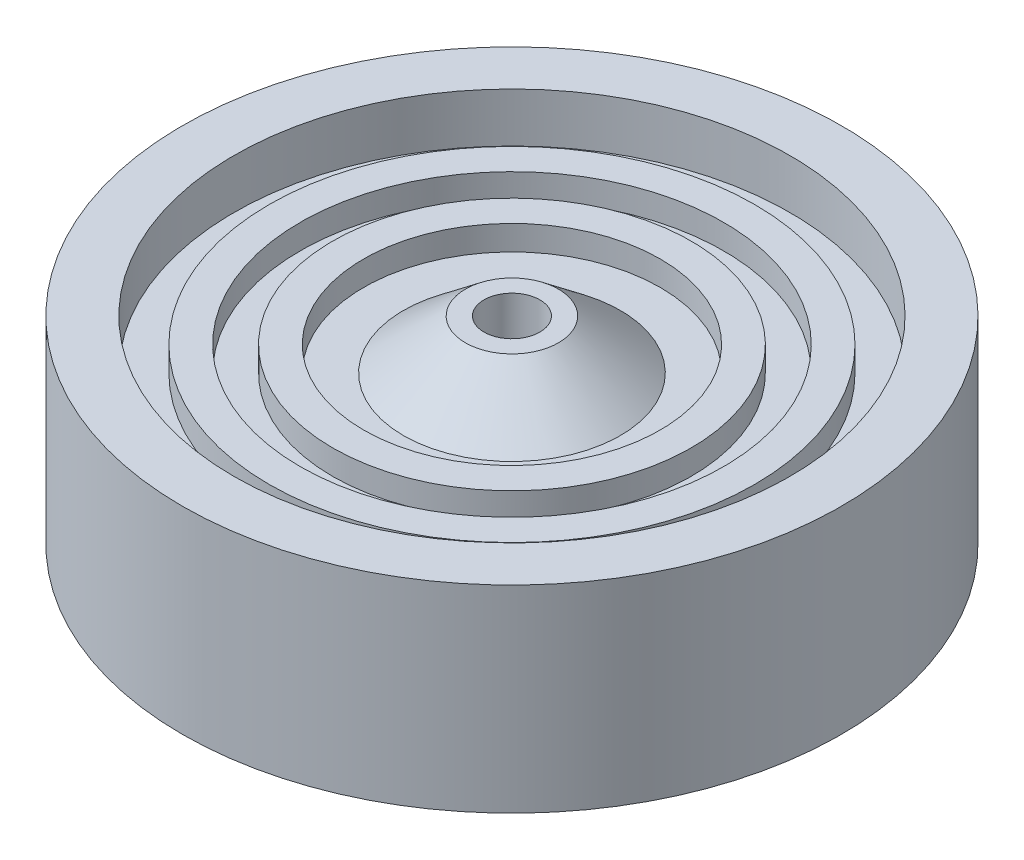
ISO-10303-21;
HEADER;
FILE_DESCRIPTION(('STEP AP214'),'2;1');
FILE_NAME('part.step','',(''),(''),'','','');
FILE_SCHEMA(('AUTOMOTIVE_DESIGN { 1 0 10303 214 1 1 1 1 }'));
ENDSEC;
DATA;
#1=APPLICATION_CONTEXT('core data for automotive mechanical design processes');
#2=APPLICATION_PROTOCOL_DEFINITION('international standard','automotive_design',2000,#1);
#3=PRODUCT_CONTEXT('',#1,'mechanical');
#4=PRODUCT('Part','Part','',(#3));
#5=PRODUCT_RELATED_PRODUCT_CATEGORY('part','',(#4));
#6=PRODUCT_DEFINITION_FORMATION('','',#4);
#7=PRODUCT_DEFINITION_CONTEXT('part definition',#1,'design');
#8=PRODUCT_DEFINITION('design','',#6,#7);
#9=PRODUCT_DEFINITION_SHAPE('','',#8);
#10=(LENGTH_UNIT() NAMED_UNIT(*) SI_UNIT(.MILLI.,.METRE.));
#11=(NAMED_UNIT(*) PLANE_ANGLE_UNIT() SI_UNIT($,.RADIAN.));
#12=(NAMED_UNIT(*) SI_UNIT($,.STERADIAN.) SOLID_ANGLE_UNIT());
#13=UNCERTAINTY_MEASURE_WITH_UNIT(LENGTH_MEASURE(1.E-05),#10,'distance_accuracy_value','');
#14=(GEOMETRIC_REPRESENTATION_CONTEXT(3) GLOBAL_UNCERTAINTY_ASSIGNED_CONTEXT((#13)) GLOBAL_UNIT_ASSIGNED_CONTEXT((#10,
#11,#12)) REPRESENTATION_CONTEXT('',''));
#15=CARTESIAN_POINT('',(0.,0.,0.));
#16=DIRECTION('',(0.,0.,1.));
#17=DIRECTION('',(1.,0.,0.));
#18=AXIS2_PLACEMENT_3D('',#15,#16,#17);
#19=CARTESIAN_POINT('',(-62.2703870083176,102.893499589616,0.));
#20=DIRECTION('',(0.,1.,0.));
#21=DIRECTION('',(0.,0.,1.));
#22=AXIS2_PLACEMENT_3D('',#19,#20,#21);
#23=PLANE('',#22);
#24=CARTESIAN_POINT('',(-50.811787608486,102.893499589616,0.));
#25=DIRECTION('',(0.,1.,0.));
#26=DIRECTION('',(0.,0.,1.));
#27=AXIS2_PLACEMENT_3D('',#24,#25,#26);
#28=CIRCLE('',#27,11.4585993998316);
#29=CARTESIAN_POINT('',(-50.811787608486,102.893499589616,11.4585993998316));
#30=VERTEX_POINT('',#29);
#31=EDGE_CURVE('E152',#30,#30,#28,.T.);
#32=ORIENTED_EDGE('',*,*,#31,.T.);
#33=EDGE_LOOP('',(#32));
#34=FACE_BOUND('',#33,.T.);
#35=CARTESIAN_POINT('',(-50.811787608486,102.893499589616,0.));
#36=DIRECTION('',(0.,1.,0.));
#37=DIRECTION('',(0.,0.,1.));
#38=AXIS2_PLACEMENT_3D('',#35,#36,#37);
#39=CIRCLE('',#38,6.8841638736265);
#40=CARTESIAN_POINT('',(-50.811787608486,102.893499589616,6.8841638736265));
#41=VERTEX_POINT('',#40);
#42=EDGE_CURVE('E10',#41,#41,#39,.T.);
#43=ORIENTED_EDGE('',*,*,#42,.F.);
#44=EDGE_LOOP('',(#43));
#45=FACE_BOUND('',#44,.T.);
#46=ADVANCED_FACE('F37',(#34,#45),#23,.T.);
#47=CARTESIAN_POINT('',(-50.811787608486,150.598792189007,0.));
#48=DIRECTION('',(0.,1.,0.));
#49=DIRECTION('',(0.,0.,1.));
#50=AXIS2_PLACEMENT_3D('',#47,#48,#49);
#51=CYLINDRICAL_SURFACE('',#50,6.8841638736265);
#52=ORIENTED_EDGE('',*,*,#42,.T.);
#53=EDGE_LOOP('',(#52));
#54=FACE_BOUND('',#53,.T.);
#55=CARTESIAN_POINT('',(-50.811787608486,54.2353215289949,0.));
#56=DIRECTION('',(0.,1.,0.));
#57=DIRECTION('',(0.,0.,1.));
#58=AXIS2_PLACEMENT_3D('',#55,#56,#57);
#59=CIRCLE('',#58,6.8841638736265);
#60=CARTESIAN_POINT('',(-50.811787608486,54.2353215289949,6.8841638736265));
#61=VERTEX_POINT('',#60);
#62=EDGE_CURVE('E44',#61,#61,#59,.T.);
#63=ORIENTED_EDGE('',*,*,#62,.F.);
#64=EDGE_LOOP('',(#63));
#65=FACE_BOUND('',#64,.T.);
#66=ADVANCED_FACE('F171',(#54,#65),#51,.F.);
#67=CARTESIAN_POINT('',(-57.6959514821125,54.2353215289949,0.));
#68=DIRECTION('',(0.,-1.,0.));
#69=DIRECTION('',(0.,0.,-1.));
#70=AXIS2_PLACEMENT_3D('',#67,#68,#69);
#71=PLANE('',#70);
#72=ORIENTED_EDGE('',*,*,#62,.T.);
#73=EDGE_LOOP('',(#72));
#74=FACE_BOUND('',#73,.T.);
#75=CARTESIAN_POINT('',(-50.811787608486,54.2353215289949,0.));
#76=DIRECTION('',(0.,1.,0.));
#77=DIRECTION('',(0.,0.,1.));
#78=AXIS2_PLACEMENT_3D('',#75,#76,#77);
#79=CIRCLE('',#78,11.4585993998316);
#80=CARTESIAN_POINT('',(-50.811787608486,54.2353215289949,11.4585993998316));
#81=VERTEX_POINT('',#80);
#82=EDGE_CURVE('E49',#81,#81,#79,.T.);
#83=ORIENTED_EDGE('',*,*,#82,.F.);
#84=EDGE_LOOP('',(#83));
#85=FACE_BOUND('',#84,.T.);
#86=ADVANCED_FACE('F175',(#74,#85),#71,.T.);
#87=CARTESIAN_POINT('',(-50.811787608486,66.3998660441503,0.));
#88=DIRECTION('',(0.,1.,0.));
#89=DIRECTION('',(0.,0.,1.));
#90=AXIS2_PLACEMENT_3D('',#87,#88,#89);
#91=CONICAL_SURFACE('',#90,26.7096701352503,0.897508871919878);
#92=ORIENTED_EDGE('',*,*,#82,.T.);
#93=EDGE_LOOP('',(#92));
#94=FACE_BOUND('',#93,.T.);
#95=CARTESIAN_POINT('',(-50.811787608486,66.3998660441503,0.));
#96=DIRECTION('',(0.,1.,0.));
#97=DIRECTION('',(0.,0.,1.));
#98=AXIS2_PLACEMENT_3D('',#95,#96,#97);
#99=CIRCLE('',#98,26.7096701352503);
#100=CARTESIAN_POINT('',(-50.811787608486,66.3998660441503,26.7096701352503));
#101=VERTEX_POINT('',#100);
#102=EDGE_CURVE('E54',#101,#101,#99,.T.);
#103=ORIENTED_EDGE('',*,*,#102,.F.);
#104=EDGE_LOOP('',(#103));
#105=FACE_BOUND('',#104,.T.);
#106=ADVANCED_FACE('F179',(#94,#105),#91,.T.);
#107=CARTESIAN_POINT('',(-77.5214577437363,66.3998660441503,0.));
#108=DIRECTION('',(0.,-1.,0.));
#109=DIRECTION('',(0.,0.,-1.));
#110=AXIS2_PLACEMENT_3D('',#107,#108,#109);
#111=PLANE('',#110);
#112=ORIENTED_EDGE('',*,*,#102,.T.);
#113=EDGE_LOOP('',(#112));
#114=FACE_BOUND('',#113,.T.);
#115=CARTESIAN_POINT('',(-50.811787608486,66.3998660441503,0.));
#116=DIRECTION('',(0.,1.,0.));
#117=DIRECTION('',(0.,0.,1.));
#118=AXIS2_PLACEMENT_3D('',#115,#116,#117);
#119=CIRCLE('',#118,36.5139298937337);
#120=CARTESIAN_POINT('',(-50.811787608486,66.3998660441503,36.5139298937337));
#121=VERTEX_POINT('',#120);
#122=EDGE_CURVE('E60',#121,#121,#119,.T.);
#123=ORIENTED_EDGE('',*,*,#122,.F.);
#124=EDGE_LOOP('',(#123));
#125=FACE_BOUND('',#124,.T.);
#126=ADVANCED_FACE('F185',(#114,#125),#111,.T.);
#127=CARTESIAN_POINT('',(-50.811787608486,150.598792189007,0.));
#128=DIRECTION('',(0.,1.,0.));
#129=DIRECTION('',(0.,0.,1.));
#130=AXIS2_PLACEMENT_3D('',#127,#128,#129);
#131=CYLINDRICAL_SURFACE('',#130,36.5139298937337);
#132=ORIENTED_EDGE('',*,*,#122,.T.);
#133=EDGE_LOOP('',(#132));
#134=FACE_BOUND('',#133,.T.);
#135=CARTESIAN_POINT('',(-50.811787608486,60.3175937865726,0.));
#136=DIRECTION('',(0.,1.,0.));
#137=DIRECTION('',(0.,0.,1.));
#138=AXIS2_PLACEMENT_3D('',#135,#136,#137);
#139=CIRCLE('',#138,36.5139298937337);
#140=CARTESIAN_POINT('',(-50.811787608486,60.3175937865726,36.5139298937337));
#141=VERTEX_POINT('',#140);
#142=EDGE_CURVE('E64',#141,#141,#139,.T.);
#143=ORIENTED_EDGE('',*,*,#142,.F.);
#144=EDGE_LOOP('',(#143));
#145=FACE_BOUND('',#144,.T.);
#146=ADVANCED_FACE('F189',(#134,#145),#131,.F.);
#147=CARTESIAN_POINT('',(-87.3257175022198,60.3175937865726,0.));
#148=DIRECTION('',(0.,-1.,0.));
#149=DIRECTION('',(0.,0.,-1.));
#150=AXIS2_PLACEMENT_3D('',#147,#148,#149);
#151=PLANE('',#150);
#152=ORIENTED_EDGE('',*,*,#142,.T.);
#153=EDGE_LOOP('',(#152));
#154=FACE_BOUND('',#153,.T.);
#155=CARTESIAN_POINT('',(-50.811787608486,60.3175937865726,0.));
#156=DIRECTION('',(0.,1.,0.));
#157=DIRECTION('',(0.,0.,1.));
#158=AXIS2_PLACEMENT_3D('',#155,#156,#157);
#159=CIRCLE('',#158,44.1339298937337);
#160=CARTESIAN_POINT('',(-50.811787608486,60.3175937865726,44.1339298937337));
#161=VERTEX_POINT('',#160);
#162=EDGE_CURVE('E68',#161,#161,#159,.T.);
#163=ORIENTED_EDGE('',*,*,#162,.F.);
#164=EDGE_LOOP('',(#163));
#165=FACE_BOUND('',#164,.T.);
#166=ADVANCED_FACE('F193',(#154,#165),#151,.T.);
#167=CARTESIAN_POINT('',(-50.811787608486,150.598792189007,0.));
#168=DIRECTION('',(0.,1.,0.));
#169=DIRECTION('',(0.,0.,1.));
#170=AXIS2_PLACEMENT_3D('',#167,#168,#169);
#171=CYLINDRICAL_SURFACE('',#170,44.1339298937337);
#172=ORIENTED_EDGE('',*,*,#162,.T.);
#173=EDGE_LOOP('',(#172));
#174=FACE_BOUND('',#173,.T.);
#175=CARTESIAN_POINT('',(-50.811787608486,66.3998660441503,0.));
#176=DIRECTION('',(0.,1.,0.));
#177=DIRECTION('',(0.,0.,1.));
#178=AXIS2_PLACEMENT_3D('',#175,#176,#177);
#179=CIRCLE('',#178,44.1339298937337);
#180=CARTESIAN_POINT('',(-50.811787608486,66.3998660441503,44.1339298937337));
#181=VERTEX_POINT('',#180);
#182=EDGE_CURVE('E72',#181,#181,#179,.T.);
#183=ORIENTED_EDGE('',*,*,#182,.F.);
#184=EDGE_LOOP('',(#183));
#185=FACE_BOUND('',#184,.T.);
#186=ADVANCED_FACE('F197',(#174,#185),#171,.T.);
#187=CARTESIAN_POINT('',(-94.9457175022198,66.3998660441503,0.));
#188=DIRECTION('',(0.,-1.,0.));
#189=DIRECTION('',(0.,0.,-1.));
#190=AXIS2_PLACEMENT_3D('',#187,#188,#189);
#191=PLANE('',#190);
#192=ORIENTED_EDGE('',*,*,#182,.T.);
#193=EDGE_LOOP('',(#192));
#194=FACE_BOUND('',#193,.T.);
#195=CARTESIAN_POINT('',(-50.811787608486,66.3998660441503,0.));
#196=DIRECTION('',(0.,1.,0.));
#197=DIRECTION('',(0.,0.,1.));
#198=AXIS2_PLACEMENT_3D('',#195,#196,#197);
#199=CIRCLE('',#198,52.1225859932388);
#200=CARTESIAN_POINT('',(-50.811787608486,66.3998660441503,52.1225859932388));
#201=VERTEX_POINT('',#200);
#202=EDGE_CURVE('E76',#201,#201,#199,.T.);
#203=ORIENTED_EDGE('',*,*,#202,.F.);
#204=EDGE_LOOP('',(#203));
#205=FACE_BOUND('',#204,.T.);
#206=ADVANCED_FACE('F201',(#194,#205),#191,.T.);
#207=CARTESIAN_POINT('',(-50.811787608486,150.598792189007,0.));
#208=DIRECTION('',(0.,1.,0.));
#209=DIRECTION('',(0.,0.,1.));
#210=AXIS2_PLACEMENT_3D('',#207,#208,#209);
#211=CYLINDRICAL_SURFACE('',#210,52.1225859932388);
#212=ORIENTED_EDGE('',*,*,#202,.T.);
#213=EDGE_LOOP('',(#212));
#214=FACE_BOUND('',#213,.T.);
#215=CARTESIAN_POINT('',(-50.811787608486,60.3175937865726,0.));
#216=DIRECTION('',(0.,1.,0.));
#217=DIRECTION('',(0.,0.,1.));
#218=AXIS2_PLACEMENT_3D('',#215,#216,#217);
#219=CIRCLE('',#218,52.1225859932388);
#220=CARTESIAN_POINT('',(-50.811787608486,60.3175937865726,52.1225859932388));
#221=VERTEX_POINT('',#220);
#222=EDGE_CURVE('E80',#221,#221,#219,.T.);
#223=ORIENTED_EDGE('',*,*,#222,.F.);
#224=EDGE_LOOP('',(#223));
#225=FACE_BOUND('',#224,.T.);
#226=ADVANCED_FACE('F205',(#214,#225),#211,.F.);
#227=CARTESIAN_POINT('',(-102.934373601725,60.3175937865726,0.));
#228=DIRECTION('',(0.,-1.,0.));
#229=DIRECTION('',(0.,0.,-1.));
#230=AXIS2_PLACEMENT_3D('',#227,#228,#229);
#231=PLANE('',#230);
#232=ORIENTED_EDGE('',*,*,#222,.T.);
#233=EDGE_LOOP('',(#232));
#234=FACE_BOUND('',#233,.T.);
#235=CARTESIAN_POINT('',(-50.811787608486,60.3175937865726,0.));
#236=DIRECTION('',(0.,1.,0.));
#237=DIRECTION('',(0.,0.,1.));
#238=AXIS2_PLACEMENT_3D('',#235,#236,#237);
#239=CIRCLE('',#238,59.7425859932388);
#240=CARTESIAN_POINT('',(-50.811787608486,60.3175937865726,59.7425859932388));
#241=VERTEX_POINT('',#240);
#242=EDGE_CURVE('E84',#241,#241,#239,.T.);
#243=ORIENTED_EDGE('',*,*,#242,.F.);
#244=EDGE_LOOP('',(#243));
#245=FACE_BOUND('',#244,.T.);
#246=ADVANCED_FACE('F209',(#234,#245),#231,.T.);
#247=CARTESIAN_POINT('',(-50.811787608486,150.598792189007,0.));
#248=DIRECTION('',(0.,1.,0.));
#249=DIRECTION('',(0.,0.,1.));
#250=AXIS2_PLACEMENT_3D('',#247,#248,#249);
#251=CYLINDRICAL_SURFACE('',#250,59.7425859932388);
#252=ORIENTED_EDGE('',*,*,#242,.T.);
#253=EDGE_LOOP('',(#252));
#254=FACE_BOUND('',#253,.T.);
#255=CARTESIAN_POINT('',(-50.811787608486,66.3998660441503,0.));
#256=DIRECTION('',(0.,1.,0.));
#257=DIRECTION('',(0.,0.,1.));
#258=AXIS2_PLACEMENT_3D('',#255,#256,#257);
#259=CIRCLE('',#258,59.7425859932388);
#260=CARTESIAN_POINT('',(-50.811787608486,66.3998660441503,59.7425859932388));
#261=VERTEX_POINT('',#260);
#262=EDGE_CURVE('E88',#261,#261,#259,.T.);
#263=ORIENTED_EDGE('',*,*,#262,.F.);
#264=EDGE_LOOP('',(#263));
#265=FACE_BOUND('',#264,.T.);
#266=ADVANCED_FACE('F213',(#254,#265),#251,.T.);
#267=CARTESIAN_POINT('',(-110.554373601725,66.3998660441503,0.));
#268=DIRECTION('',(0.,-1.,0.));
#269=DIRECTION('',(0.,0.,-1.));
#270=AXIS2_PLACEMENT_3D('',#267,#268,#269);
#271=PLANE('',#270);
#272=ORIENTED_EDGE('',*,*,#262,.T.);
#273=EDGE_LOOP('',(#272));
#274=FACE_BOUND('',#273,.T.);
#275=CARTESIAN_POINT('',(-50.811787608486,66.3998660441503,0.));
#276=DIRECTION('',(0.,1.,0.));
#277=DIRECTION('',(0.,0.,1.));
#278=AXIS2_PLACEMENT_3D('',#275,#276,#277);
#279=CIRCLE('',#278,68.4574835563352);
#280=CARTESIAN_POINT('',(-50.811787608486,66.3998660441503,68.4574835563352));
#281=VERTEX_POINT('',#280);
#282=EDGE_CURVE('E92',#281,#281,#279,.T.);
#283=ORIENTED_EDGE('',*,*,#282,.F.);
#284=EDGE_LOOP('',(#283));
#285=FACE_BOUND('',#284,.T.);
#286=ADVANCED_FACE('F217',(#274,#285),#271,.T.);
#287=CARTESIAN_POINT('',(-50.811787608486,150.598792189007,0.));
#288=DIRECTION('',(0.,1.,0.));
#289=DIRECTION('',(0.,0.,1.));
#290=AXIS2_PLACEMENT_3D('',#287,#288,#289);
#291=CYLINDRICAL_SURFACE('',#290,68.4574835563352);
#292=ORIENTED_EDGE('',*,*,#282,.T.);
#293=EDGE_LOOP('',(#292));
#294=FACE_BOUND('',#293,.T.);
#295=CARTESIAN_POINT('',(-50.811787608486,54.2353215289949,0.));
#296=DIRECTION('',(0.,1.,0.));
#297=DIRECTION('',(0.,0.,1.));
#298=AXIS2_PLACEMENT_3D('',#295,#296,#297);
#299=CIRCLE('',#298,68.4574835563352);
#300=CARTESIAN_POINT('',(-50.811787608486,54.2353215289949,68.4574835563352));
#301=VERTEX_POINT('',#300);
#302=EDGE_CURVE('E96',#301,#301,#299,.T.);
#303=ORIENTED_EDGE('',*,*,#302,.F.);
#304=EDGE_LOOP('',(#303));
#305=FACE_BOUND('',#304,.T.);
#306=ADVANCED_FACE('F221',(#294,#305),#291,.F.);
#307=CARTESIAN_POINT('',(-119.269271164821,54.2353215289949,0.));
#308=DIRECTION('',(0.,-1.,0.));
#309=DIRECTION('',(0.,0.,-1.));
#310=AXIS2_PLACEMENT_3D('',#307,#308,#309);
#311=PLANE('',#310);
#312=ORIENTED_EDGE('',*,*,#302,.T.);
#313=EDGE_LOOP('',(#312));
#314=FACE_BOUND('',#313,.T.);
#315=CARTESIAN_POINT('',(-50.811787608486,54.2353215289949,0.));
#316=DIRECTION('',(0.,1.,0.));
#317=DIRECTION('',(0.,0.,1.));
#318=AXIS2_PLACEMENT_3D('',#315,#316,#317);
#319=CIRCLE('',#318,81.1574835563352);
#320=CARTESIAN_POINT('',(-50.811787608486,54.2353215289949,81.1574835563352));
#321=VERTEX_POINT('',#320);
#322=EDGE_CURVE('E100',#321,#321,#319,.T.);
#323=ORIENTED_EDGE('',*,*,#322,.F.);
#324=EDGE_LOOP('',(#323));
#325=FACE_BOUND('',#324,.T.);
#326=ADVANCED_FACE('F225',(#314,#325),#311,.T.);
#327=CARTESIAN_POINT('',(-50.811787608486,150.598792189007,0.));
#328=DIRECTION('',(0.,1.,0.));
#329=DIRECTION('',(0.,0.,1.));
#330=AXIS2_PLACEMENT_3D('',#327,#328,#329);
#331=CYLINDRICAL_SURFACE('',#330,81.1574835563352);
#332=ORIENTED_EDGE('',*,*,#322,.T.);
#333=EDGE_LOOP('',(#332));
#334=FACE_BOUND('',#333,.T.);
#335=CARTESIAN_POINT('',(-50.811787608486,102.893499589616,0.));
#336=DIRECTION('',(0.,1.,0.));
#337=DIRECTION('',(0.,0.,1.));
#338=AXIS2_PLACEMENT_3D('',#335,#336,#337);
#339=CIRCLE('',#338,81.1574835563352);
#340=CARTESIAN_POINT('',(-50.811787608486,102.893499589616,81.1574835563352));
#341=VERTEX_POINT('',#340);
#342=EDGE_CURVE('E104',#341,#341,#339,.T.);
#343=ORIENTED_EDGE('',*,*,#342,.F.);
#344=EDGE_LOOP('',(#343));
#345=FACE_BOUND('',#344,.T.);
#346=ADVANCED_FACE('F229',(#334,#345),#331,.T.);
#347=CARTESIAN_POINT('',(-119.269271164821,102.893499589616,0.));
#348=DIRECTION('',(0.,1.,0.));
#349=DIRECTION('',(0.,0.,1.));
#350=AXIS2_PLACEMENT_3D('',#347,#348,#349);
#351=PLANE('',#350);
#352=ORIENTED_EDGE('',*,*,#342,.T.);
#353=EDGE_LOOP('',(#352));
#354=FACE_BOUND('',#353,.T.);
#355=CARTESIAN_POINT('',(-50.811787608486,102.893499589616,0.));
#356=DIRECTION('',(0.,1.,0.));
#357=DIRECTION('',(0.,0.,1.));
#358=AXIS2_PLACEMENT_3D('',#355,#356,#357);
#359=CIRCLE('',#358,68.4574835563352);
#360=CARTESIAN_POINT('',(-50.811787608486,102.893499589616,68.4574835563352));
#361=VERTEX_POINT('',#360);
#362=EDGE_CURVE('E108',#361,#361,#359,.T.);
#363=ORIENTED_EDGE('',*,*,#362,.F.);
#364=EDGE_LOOP('',(#363));
#365=FACE_BOUND('',#364,.T.);
#366=ADVANCED_FACE('F233',(#354,#365),#351,.T.);
#367=CARTESIAN_POINT('',(-50.811787608486,150.598792189007,0.));
#368=DIRECTION('',(0.,1.,0.));
#369=DIRECTION('',(0.,0.,1.));
#370=AXIS2_PLACEMENT_3D('',#367,#368,#369);
#371=CYLINDRICAL_SURFACE('',#370,68.4574835563352);
#372=ORIENTED_EDGE('',*,*,#362,.T.);
#373=EDGE_LOOP('',(#372));
#374=FACE_BOUND('',#373,.T.);
#375=CARTESIAN_POINT('',(-50.811787608486,90.7289550744611,0.));
#376=DIRECTION('',(0.,1.,0.));
#377=DIRECTION('',(0.,0.,1.));
#378=AXIS2_PLACEMENT_3D('',#375,#376,#377);
#379=CIRCLE('',#378,68.4574835563352);
#380=CARTESIAN_POINT('',(-50.811787608486,90.7289550744611,68.4574835563352));
#381=VERTEX_POINT('',#380);
#382=EDGE_CURVE('E112',#381,#381,#379,.T.);
#383=ORIENTED_EDGE('',*,*,#382,.F.);
#384=EDGE_LOOP('',(#383));
#385=FACE_BOUND('',#384,.T.);
#386=ADVANCED_FACE('F237',(#374,#385),#371,.F.);
#387=CARTESIAN_POINT('',(-110.554373601725,90.7289550744611,0.));
#388=DIRECTION('',(0.,1.,0.));
#389=DIRECTION('',(0.,0.,1.));
#390=AXIS2_PLACEMENT_3D('',#387,#388,#389);
#391=PLANE('',#390);
#392=ORIENTED_EDGE('',*,*,#382,.T.);
#393=EDGE_LOOP('',(#392));
#394=FACE_BOUND('',#393,.T.);
#395=CARTESIAN_POINT('',(-50.811787608486,90.7289550744611,0.));
#396=DIRECTION('',(0.,1.,0.));
#397=DIRECTION('',(0.,0.,1.));
#398=AXIS2_PLACEMENT_3D('',#395,#396,#397);
#399=CIRCLE('',#398,59.7425859932388);
#400=CARTESIAN_POINT('',(-50.811787608486,90.7289550744611,59.7425859932388));
#401=VERTEX_POINT('',#400);
#402=EDGE_CURVE('E116',#401,#401,#399,.T.);
#403=ORIENTED_EDGE('',*,*,#402,.F.);
#404=EDGE_LOOP('',(#403));
#405=FACE_BOUND('',#404,.T.);
#406=ADVANCED_FACE('F241',(#394,#405),#391,.T.);
#407=CARTESIAN_POINT('',(-50.811787608486,150.598792189007,0.));
#408=DIRECTION('',(0.,1.,0.));
#409=DIRECTION('',(0.,0.,1.));
#410=AXIS2_PLACEMENT_3D('',#407,#408,#409);
#411=CYLINDRICAL_SURFACE('',#410,59.7425859932388);
#412=ORIENTED_EDGE('',*,*,#402,.T.);
#413=EDGE_LOOP('',(#412));
#414=FACE_BOUND('',#413,.T.);
#415=CARTESIAN_POINT('',(-50.811787608486,96.8112273320388,0.));
#416=DIRECTION('',(0.,1.,0.));
#417=DIRECTION('',(0.,0.,1.));
#418=AXIS2_PLACEMENT_3D('',#415,#416,#417);
#419=CIRCLE('',#418,59.7425859932388);
#420=CARTESIAN_POINT('',(-50.811787608486,96.8112273320388,59.7425859932388));
#421=VERTEX_POINT('',#420);
#422=EDGE_CURVE('E120',#421,#421,#419,.T.);
#423=ORIENTED_EDGE('',*,*,#422,.F.);
#424=EDGE_LOOP('',(#423));
#425=FACE_BOUND('',#424,.T.);
#426=ADVANCED_FACE('F245',(#414,#425),#411,.T.);
#427=CARTESIAN_POINT('',(-102.934373601725,96.8112273320388,0.));
#428=DIRECTION('',(0.,1.,0.));
#429=DIRECTION('',(0.,0.,1.));
#430=AXIS2_PLACEMENT_3D('',#427,#428,#429);
#431=PLANE('',#430);
#432=ORIENTED_EDGE('',*,*,#422,.T.);
#433=EDGE_LOOP('',(#432));
#434=FACE_BOUND('',#433,.T.);
#435=CARTESIAN_POINT('',(-50.811787608486,96.8112273320388,0.));
#436=DIRECTION('',(0.,1.,0.));
#437=DIRECTION('',(0.,0.,1.));
#438=AXIS2_PLACEMENT_3D('',#435,#436,#437);
#439=CIRCLE('',#438,52.1225859932388);
#440=CARTESIAN_POINT('',(-50.811787608486,96.8112273320388,52.1225859932388));
#441=VERTEX_POINT('',#440);
#442=EDGE_CURVE('E124',#441,#441,#439,.T.);
#443=ORIENTED_EDGE('',*,*,#442,.F.);
#444=EDGE_LOOP('',(#443));
#445=FACE_BOUND('',#444,.T.);
#446=ADVANCED_FACE('F249',(#434,#445),#431,.T.);
#447=CARTESIAN_POINT('',(-50.811787608486,150.598792189007,0.));
#448=DIRECTION('',(0.,1.,0.));
#449=DIRECTION('',(0.,0.,1.));
#450=AXIS2_PLACEMENT_3D('',#447,#448,#449);
#451=CYLINDRICAL_SURFACE('',#450,52.1225859932388);
#452=ORIENTED_EDGE('',*,*,#442,.T.);
#453=EDGE_LOOP('',(#452));
#454=FACE_BOUND('',#453,.T.);
#455=CARTESIAN_POINT('',(-50.811787608486,90.7289550744611,0.));
#456=DIRECTION('',(0.,1.,0.));
#457=DIRECTION('',(0.,0.,1.));
#458=AXIS2_PLACEMENT_3D('',#455,#456,#457);
#459=CIRCLE('',#458,52.1225859932388);
#460=CARTESIAN_POINT('',(-50.811787608486,90.7289550744611,52.1225859932388));
#461=VERTEX_POINT('',#460);
#462=EDGE_CURVE('E128',#461,#461,#459,.T.);
#463=ORIENTED_EDGE('',*,*,#462,.F.);
#464=EDGE_LOOP('',(#463));
#465=FACE_BOUND('',#464,.T.);
#466=ADVANCED_FACE('F253',(#454,#465),#451,.F.);
#467=CARTESIAN_POINT('',(-94.9457175022198,90.7289550744611,0.));
#468=DIRECTION('',(0.,1.,0.));
#469=DIRECTION('',(0.,0.,1.));
#470=AXIS2_PLACEMENT_3D('',#467,#468,#469);
#471=PLANE('',#470);
#472=ORIENTED_EDGE('',*,*,#462,.T.);
#473=EDGE_LOOP('',(#472));
#474=FACE_BOUND('',#473,.T.);
#475=CARTESIAN_POINT('',(-50.811787608486,90.7289550744611,0.));
#476=DIRECTION('',(0.,1.,0.));
#477=DIRECTION('',(0.,0.,1.));
#478=AXIS2_PLACEMENT_3D('',#475,#476,#477);
#479=CIRCLE('',#478,44.1339298937337);
#480=CARTESIAN_POINT('',(-50.811787608486,90.7289550744611,44.1339298937337));
#481=VERTEX_POINT('',#480);
#482=EDGE_CURVE('E132',#481,#481,#479,.T.);
#483=ORIENTED_EDGE('',*,*,#482,.F.);
#484=EDGE_LOOP('',(#483));
#485=FACE_BOUND('',#484,.T.);
#486=ADVANCED_FACE('F257',(#474,#485),#471,.T.);
#487=CARTESIAN_POINT('',(-50.811787608486,150.598792189007,0.));
#488=DIRECTION('',(0.,1.,0.));
#489=DIRECTION('',(0.,0.,1.));
#490=AXIS2_PLACEMENT_3D('',#487,#488,#489);
#491=CYLINDRICAL_SURFACE('',#490,44.1339298937337);
#492=ORIENTED_EDGE('',*,*,#482,.T.);
#493=EDGE_LOOP('',(#492));
#494=FACE_BOUND('',#493,.T.);
#495=CARTESIAN_POINT('',(-50.811787608486,96.8112273320388,0.));
#496=DIRECTION('',(0.,1.,0.));
#497=DIRECTION('',(0.,0.,1.));
#498=AXIS2_PLACEMENT_3D('',#495,#496,#497);
#499=CIRCLE('',#498,44.1339298937337);
#500=CARTESIAN_POINT('',(-50.811787608486,96.8112273320388,44.1339298937337));
#501=VERTEX_POINT('',#500);
#502=EDGE_CURVE('E136',#501,#501,#499,.T.);
#503=ORIENTED_EDGE('',*,*,#502,.F.);
#504=EDGE_LOOP('',(#503));
#505=FACE_BOUND('',#504,.T.);
#506=ADVANCED_FACE('F261',(#494,#505),#491,.T.);
#507=CARTESIAN_POINT('',(-87.3257175022198,96.8112273320388,0.));
#508=DIRECTION('',(0.,1.,0.));
#509=DIRECTION('',(0.,0.,1.));
#510=AXIS2_PLACEMENT_3D('',#507,#508,#509);
#511=PLANE('',#510);
#512=ORIENTED_EDGE('',*,*,#502,.T.);
#513=EDGE_LOOP('',(#512));
#514=FACE_BOUND('',#513,.T.);
#515=CARTESIAN_POINT('',(-50.811787608486,96.8112273320388,0.));
#516=DIRECTION('',(0.,1.,0.));
#517=DIRECTION('',(0.,0.,1.));
#518=AXIS2_PLACEMENT_3D('',#515,#516,#517);
#519=CIRCLE('',#518,36.5139298937337);
#520=CARTESIAN_POINT('',(-50.811787608486,96.8112273320388,36.5139298937337));
#521=VERTEX_POINT('',#520);
#522=EDGE_CURVE('E140',#521,#521,#519,.T.);
#523=ORIENTED_EDGE('',*,*,#522,.F.);
#524=EDGE_LOOP('',(#523));
#525=FACE_BOUND('',#524,.T.);
#526=ADVANCED_FACE('F265',(#514,#525),#511,.T.);
#527=CARTESIAN_POINT('',(-50.811787608486,150.598792189007,0.));
#528=DIRECTION('',(0.,1.,0.));
#529=DIRECTION('',(0.,0.,1.));
#530=AXIS2_PLACEMENT_3D('',#527,#528,#529);
#531=CYLINDRICAL_SURFACE('',#530,36.5139298937337);
#532=ORIENTED_EDGE('',*,*,#522,.T.);
#533=EDGE_LOOP('',(#532));
#534=FACE_BOUND('',#533,.T.);
#535=CARTESIAN_POINT('',(-50.811787608486,90.7289550744611,0.));
#536=DIRECTION('',(0.,1.,0.));
#537=DIRECTION('',(0.,0.,1.));
#538=AXIS2_PLACEMENT_3D('',#535,#536,#537);
#539=CIRCLE('',#538,36.5139298937337);
#540=CARTESIAN_POINT('',(-50.811787608486,90.7289550744611,36.5139298937337));
#541=VERTEX_POINT('',#540);
#542=EDGE_CURVE('E144',#541,#541,#539,.T.);
#543=ORIENTED_EDGE('',*,*,#542,.F.);
#544=EDGE_LOOP('',(#543));
#545=FACE_BOUND('',#544,.T.);
#546=ADVANCED_FACE('F167',(#534,#545),#531,.F.);
#547=CARTESIAN_POINT('',(-77.5214577437363,90.7289550744611,0.));
#548=DIRECTION('',(0.,1.,0.));
#549=DIRECTION('',(0.,0.,1.));
#550=AXIS2_PLACEMENT_3D('',#547,#548,#549);
#551=PLANE('',#550);
#552=ORIENTED_EDGE('',*,*,#542,.T.);
#553=EDGE_LOOP('',(#552));
#554=FACE_BOUND('',#553,.T.);
#555=CARTESIAN_POINT('',(-50.811787608486,90.7289550744611,0.));
#556=DIRECTION('',(0.,1.,0.));
#557=DIRECTION('',(0.,0.,1.));
#558=AXIS2_PLACEMENT_3D('',#555,#556,#557);
#559=CIRCLE('',#558,26.7096701352503);
#560=CARTESIAN_POINT('',(-50.811787608486,90.7289550744611,26.7096701352503));
#561=VERTEX_POINT('',#560);
#562=EDGE_CURVE('E148',#561,#561,#559,.T.);
#563=ORIENTED_EDGE('',*,*,#562,.F.);
#564=EDGE_LOOP('',(#563));
#565=FACE_BOUND('',#564,.T.);
#566=ADVANCED_FACE('F161',(#554,#565),#551,.T.);
#567=CARTESIAN_POINT('',(-50.811787608486,102.893499589616,0.));
#568=DIRECTION('',(0.,-1.,0.));
#569=DIRECTION('',(0.,0.,-1.));
#570=AXIS2_PLACEMENT_3D('',#567,#568,#569);
#571=CONICAL_SURFACE('',#570,11.4585993998316,0.897508871919878);
#572=ORIENTED_EDGE('',*,*,#562,.T.);
#573=EDGE_LOOP('',(#572));
#574=FACE_BOUND('',#573,.T.);
#575=ORIENTED_EDGE('',*,*,#31,.F.);
#576=EDGE_LOOP('',(#575));
#577=FACE_BOUND('',#576,.T.);
#578=ADVANCED_FACE('F159',(#574,#577),#571,.T.);
#579=CLOSED_SHELL('',(#46,#66,#86,#106,#126,#146,#166,#186,#206,#226,#246,#266,#286,#306,#326,
#346,#366,#386,#406,#426,#446,#466,#486,#506,#526,#546,#566,#578));
#580=MANIFOLD_SOLID_BREP('B2',#579);
#581=ADVANCED_BREP_SHAPE_REPRESENTATION('',(#18,#580),#14);
#582=SHAPE_DEFINITION_REPRESENTATION(#9,#581);
ENDSEC;
END-ISO-10303-21;
